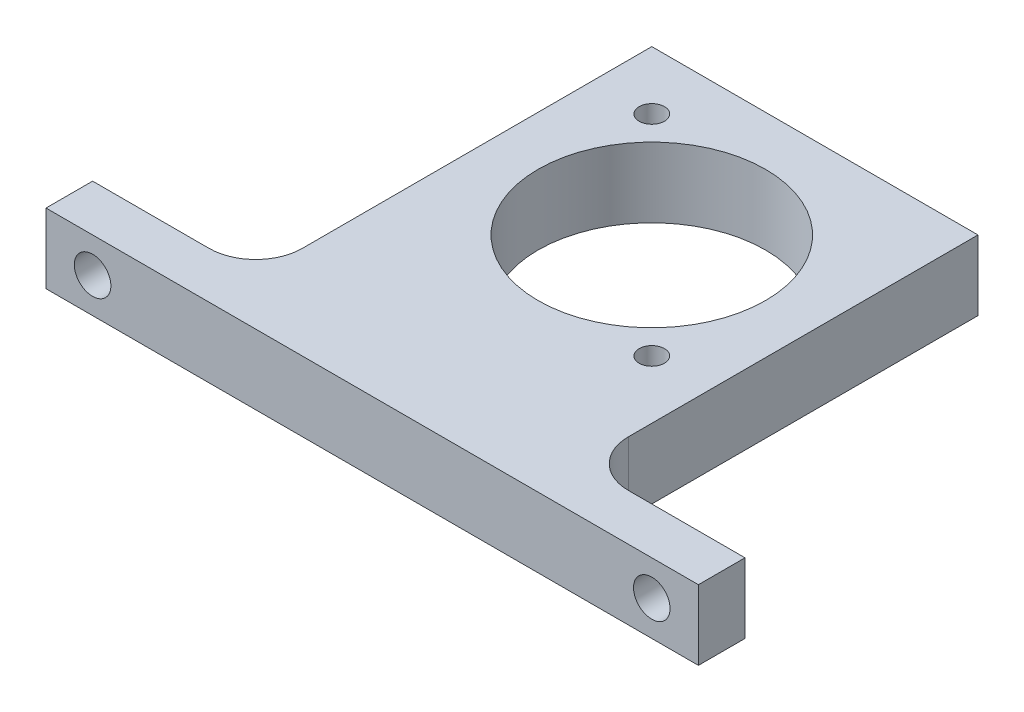
ISO-10303-21;
HEADER;
FILE_DESCRIPTION(('STEP AP214'),'2;1');
FILE_NAME('part.step','',(''),(''),'','','');
FILE_SCHEMA(('AUTOMOTIVE_DESIGN { 1 0 10303 214 1 1 1 1 }'));
ENDSEC;
DATA;
#1=APPLICATION_CONTEXT('core data for automotive mechanical design processes');
#2=APPLICATION_PROTOCOL_DEFINITION('international standard','automotive_design',2000,#1);
#3=PRODUCT_CONTEXT('',#1,'mechanical');
#4=PRODUCT('Part','Part','',(#3));
#5=PRODUCT_RELATED_PRODUCT_CATEGORY('part','',(#4));
#6=PRODUCT_DEFINITION_FORMATION('','',#4);
#7=PRODUCT_DEFINITION_CONTEXT('part definition',#1,'design');
#8=PRODUCT_DEFINITION('design','',#6,#7);
#9=PRODUCT_DEFINITION_SHAPE('','',#8);
#10=(LENGTH_UNIT() NAMED_UNIT(*) SI_UNIT(.MILLI.,.METRE.));
#11=(NAMED_UNIT(*) PLANE_ANGLE_UNIT() SI_UNIT($,.RADIAN.));
#12=(NAMED_UNIT(*) SI_UNIT($,.STERADIAN.) SOLID_ANGLE_UNIT());
#13=UNCERTAINTY_MEASURE_WITH_UNIT(LENGTH_MEASURE(1.E-05),#10,'distance_accuracy_value','');
#14=(GEOMETRIC_REPRESENTATION_CONTEXT(3) GLOBAL_UNCERTAINTY_ASSIGNED_CONTEXT((#13)) GLOBAL_UNIT_ASSIGNED_CONTEXT((#10,
#11,#12)) REPRESENTATION_CONTEXT('',''));
#15=CARTESIAN_POINT('',(0.,0.,0.));
#16=DIRECTION('',(0.,0.,1.));
#17=DIRECTION('',(1.,0.,0.));
#18=AXIS2_PLACEMENT_3D('',#15,#16,#17);
#19=CARTESIAN_POINT('',(-22.225,9.525,-22.225));
#20=DIRECTION('',(1.,0.,0.));
#21=DIRECTION('',(0.,0.,-1.));
#22=AXIS2_PLACEMENT_3D('',#19,#20,#21);
#23=PLANE('',#22);
#24=DIRECTION('',(0.,0.,1.));
#25=VECTOR('',#24,1.);
#26=CARTESIAN_POINT('',(-22.225,0.,-22.225));
#27=LINE('',#26,#25);
#28=CARTESIAN_POINT('',(-22.225,0.,-22.225));
#29=VERTEX_POINT('',#28);
#30=CARTESIAN_POINT('',(-22.225,0.,25.4));
#31=VERTEX_POINT('',#30);
#32=EDGE_CURVE('E158',#29,#31,#27,.T.);
#33=ORIENTED_EDGE('',*,*,#32,.T.);
#34=DIRECTION('',(0.,-1.,0.));
#35=VECTOR('',#34,1.);
#36=CARTESIAN_POINT('',(-22.225,9.525,25.4));
#37=LINE('',#36,#35);
#38=CARTESIAN_POINT('',(-22.225,9.525,25.4));
#39=VERTEX_POINT('',#38);
#40=EDGE_CURVE('E59',#31,#39,#37,.F.);
#41=ORIENTED_EDGE('',*,*,#40,.T.);
#42=DIRECTION('',(0.,0.,1.));
#43=VECTOR('',#42,1.);
#44=CARTESIAN_POINT('',(-22.225,9.525,-22.225));
#45=LINE('',#44,#43);
#46=CARTESIAN_POINT('',(-22.225,9.525,-22.225));
#47=VERTEX_POINT('',#46);
#48=EDGE_CURVE('E163',#47,#39,#45,.T.);
#49=ORIENTED_EDGE('',*,*,#48,.F.);
#50=DIRECTION('',(0.,-1.,0.));
#51=VECTOR('',#50,1.);
#52=CARTESIAN_POINT('',(-22.225,9.525,-22.225));
#53=LINE('',#52,#51);
#54=EDGE_CURVE('E172',#47,#29,#53,.T.);
#55=ORIENTED_EDGE('',*,*,#54,.T.);
#56=EDGE_LOOP('',(#33,#41,#49,#55));
#57=FACE_BOUND('',#56,.T.);
#58=ADVANCED_FACE('F38',(#57),#23,.F.);
#59=CARTESIAN_POINT('',(22.225,9.525,-22.225));
#60=DIRECTION('',(-1.,0.,0.));
#61=DIRECTION('',(0.,0.,1.));
#62=AXIS2_PLACEMENT_3D('',#59,#60,#61);
#63=PLANE('',#62);
#64=DIRECTION('',(0.,0.,-1.));
#65=VECTOR('',#64,1.);
#66=CARTESIAN_POINT('',(22.225,9.525,-22.225));
#67=LINE('',#66,#65);
#68=CARTESIAN_POINT('',(22.225,9.525,25.4));
#69=VERTEX_POINT('',#68);
#70=CARTESIAN_POINT('',(22.225,9.525,-22.225));
#71=VERTEX_POINT('',#70);
#72=EDGE_CURVE('E168',#69,#71,#67,.T.);
#73=ORIENTED_EDGE('',*,*,#72,.F.);
#74=DIRECTION('',(0.,1.,0.));
#75=VECTOR('',#74,1.);
#76=CARTESIAN_POINT('',(22.225,0.,25.4));
#77=LINE('',#76,#75);
#78=CARTESIAN_POINT('',(22.225,0.,25.4));
#79=VERTEX_POINT('',#78);
#80=EDGE_CURVE('E186',#69,#79,#77,.F.);
#81=ORIENTED_EDGE('',*,*,#80,.T.);
#82=DIRECTION('',(0.,0.,-1.));
#83=VECTOR('',#82,1.);
#84=CARTESIAN_POINT('',(22.225,0.,-22.225));
#85=LINE('',#84,#83);
#86=CARTESIAN_POINT('',(22.225,0.,-22.225));
#87=VERTEX_POINT('',#86);
#88=EDGE_CURVE('E175',#79,#87,#85,.T.);
#89=ORIENTED_EDGE('',*,*,#88,.T.);
#90=DIRECTION('',(0.,-1.,0.));
#91=VECTOR('',#90,1.);
#92=CARTESIAN_POINT('',(22.225,9.525,-22.225));
#93=LINE('',#92,#91);
#94=EDGE_CURVE('E180',#71,#87,#93,.T.);
#95=ORIENTED_EDGE('',*,*,#94,.F.);
#96=EDGE_LOOP('',(#73,#81,#89,#95));
#97=FACE_BOUND('',#96,.T.);
#98=ADVANCED_FACE('F211',(#97),#63,.F.);
#99=CARTESIAN_POINT('',(-22.225,9.525,38.1));
#100=DIRECTION('',(0.,0.,-1.));
#101=DIRECTION('',(-1.,0.,0.));
#102=AXIS2_PLACEMENT_3D('',#99,#100,#101);
#103=PLANE('',#102);
#104=CARTESIAN_POINT('',(-38.1,4.7625,38.1));
#105=DIRECTION('',(0.,0.,1.));
#106=DIRECTION('',(1.,0.,0.));
#107=AXIS2_PLACEMENT_3D('',#104,#105,#106);
#108=CIRCLE('',#107,2.4892);
#109=CARTESIAN_POINT('',(-35.6108,4.7625,38.1));
#110=VERTEX_POINT('',#109);
#111=EDGE_CURVE('E295',#110,#110,#108,.T.);
#112=ORIENTED_EDGE('',*,*,#111,.F.);
#113=EDGE_LOOP('',(#112));
#114=FACE_BOUND('',#113,.T.);
#115=CARTESIAN_POINT('',(38.1,4.7625,38.1));
#116=DIRECTION('',(0.,0.,1.));
#117=DIRECTION('',(-1.,0.,0.));
#118=AXIS2_PLACEMENT_3D('',#115,#116,#117);
#119=CIRCLE('',#118,2.4892);
#120=CARTESIAN_POINT('',(35.6108,4.7625,38.1));
#121=VERTEX_POINT('',#120);
#122=EDGE_CURVE('E294',#121,#121,#119,.T.);
#123=ORIENTED_EDGE('',*,*,#122,.F.);
#124=EDGE_LOOP('',(#123));
#125=FACE_BOUND('',#124,.T.);
#126=DIRECTION('',(1.,0.,0.));
#127=VECTOR('',#126,1.);
#128=CARTESIAN_POINT('',(-22.225,0.,38.1));
#129=LINE('',#128,#127);
#130=CARTESIAN_POINT('',(-44.45,0.,38.1));
#131=VERTEX_POINT('',#130);
#132=CARTESIAN_POINT('',(44.45,0.,38.1));
#133=VERTEX_POINT('',#132);
#134=EDGE_CURVE('E118',#131,#133,#129,.T.);
#135=ORIENTED_EDGE('',*,*,#134,.T.);
#136=DIRECTION('',(0.,1.,0.));
#137=VECTOR('',#136,1.);
#138=CARTESIAN_POINT('',(44.45,0.,38.1));
#139=LINE('',#138,#137);
#140=CARTESIAN_POINT('',(44.45,9.525,38.1));
#141=VERTEX_POINT('',#140);
#142=EDGE_CURVE('E141',#133,#141,#139,.T.);
#143=ORIENTED_EDGE('',*,*,#142,.T.);
#144=DIRECTION('',(1.,0.,0.));
#145=VECTOR('',#144,1.);
#146=CARTESIAN_POINT('',(-22.225,9.525,38.1));
#147=LINE('',#146,#145);
#148=CARTESIAN_POINT('',(-44.45,9.525,38.1));
#149=VERTEX_POINT('',#148);
#150=EDGE_CURVE('E165',#149,#141,#147,.T.);
#151=ORIENTED_EDGE('',*,*,#150,.F.);
#152=DIRECTION('',(0.,-1.,0.));
#153=VECTOR('',#152,1.);
#154=CARTESIAN_POINT('',(-44.45,0.,38.1));
#155=LINE('',#154,#153);
#156=EDGE_CURVE('E144',#149,#131,#155,.T.);
#157=ORIENTED_EDGE('',*,*,#156,.T.);
#158=EDGE_LOOP('',(#135,#143,#151,#157));
#159=FACE_BOUND('',#158,.T.);
#160=ADVANCED_FACE('F232',(#114,#125,#159),#103,.F.);
#161=CARTESIAN_POINT('',(-22.225,9.525,-22.225));
#162=DIRECTION('',(0.,0.,1.));
#163=DIRECTION('',(1.,0.,0.));
#164=AXIS2_PLACEMENT_3D('',#161,#162,#163);
#165=PLANE('',#164);
#166=DIRECTION('',(-1.,0.,0.));
#167=VECTOR('',#166,1.);
#168=CARTESIAN_POINT('',(-22.225,0.,-22.225));
#169=LINE('',#168,#167);
#170=EDGE_CURVE('E166',#87,#29,#169,.T.);
#171=ORIENTED_EDGE('',*,*,#170,.T.);
#172=ORIENTED_EDGE('',*,*,#54,.F.);
#173=DIRECTION('',(-1.,0.,0.));
#174=VECTOR('',#173,1.);
#175=CARTESIAN_POINT('',(-22.225,9.525,-22.225));
#176=LINE('',#175,#174);
#177=EDGE_CURVE('E170',#71,#47,#176,.T.);
#178=ORIENTED_EDGE('',*,*,#177,.F.);
#179=ORIENTED_EDGE('',*,*,#94,.T.);
#180=EDGE_LOOP('',(#171,#172,#178,#179));
#181=FACE_BOUND('',#180,.T.);
#182=ADVANCED_FACE('F215',(#181),#165,.F.);
#183=CARTESIAN_POINT('',(0.,9.525,0.));
#184=DIRECTION('',(0.,1.,0.));
#185=DIRECTION('',(0.,0.,1.));
#186=AXIS2_PLACEMENT_3D('',#183,#184,#185);
#187=PLANE('',#186);
#188=CARTESIAN_POINT('',(14.2786072325,9.525,14.2786072324999));
#189=DIRECTION('',(0.,1.,0.));
#190=DIRECTION('',(0.,0.,1.));
#191=AXIS2_PLACEMENT_3D('',#188,#189,#190);
#192=CIRCLE('',#191,1.7272);
#193=CARTESIAN_POINT('',(14.2786072325,9.525,16.0058072324999));
#194=VERTEX_POINT('',#193);
#195=EDGE_CURVE('E287',#194,#194,#192,.T.);
#196=ORIENTED_EDGE('',*,*,#195,.F.);
#197=EDGE_LOOP('',(#196));
#198=FACE_BOUND('',#197,.T.);
#199=CARTESIAN_POINT('',(-14.2786072325,9.525,-14.2786072324999));
#200=DIRECTION('',(0.,1.,0.));
#201=DIRECTION('',(0.,0.,1.));
#202=AXIS2_PLACEMENT_3D('',#199,#200,#201);
#203=CIRCLE('',#202,1.7272);
#204=CARTESIAN_POINT('',(-14.2786072325,9.525,-12.5514072324999));
#205=VERTEX_POINT('',#204);
#206=EDGE_CURVE('E274',#205,#205,#203,.T.);
#207=ORIENTED_EDGE('',*,*,#206,.F.);
#208=EDGE_LOOP('',(#207));
#209=FACE_BOUND('',#208,.T.);
#210=CARTESIAN_POINT('',(0.,9.525,0.));
#211=DIRECTION('',(0.,1.,0.));
#212=DIRECTION('',(0.,0.,1.));
#213=AXIS2_PLACEMENT_3D('',#210,#211,#212);
#214=CIRCLE('',#213,15.494);
#215=CARTESIAN_POINT('',(0.,9.525,15.494));
#216=VERTEX_POINT('',#215);
#217=EDGE_CURVE('E279',#216,#216,#214,.T.);
#218=ORIENTED_EDGE('',*,*,#217,.F.);
#219=EDGE_LOOP('',(#218));
#220=FACE_BOUND('',#219,.T.);
#221=ORIENTED_EDGE('',*,*,#150,.T.);
#222=DIRECTION('',(0.,0.,1.));
#223=VECTOR('',#222,1.);
#224=CARTESIAN_POINT('',(44.45,9.525,31.75));
#225=LINE('',#224,#223);
#226=CARTESIAN_POINT('',(44.45,9.525,31.75));
#227=VERTEX_POINT('',#226);
#228=EDGE_CURVE('E159',#227,#141,#225,.T.);
#229=ORIENTED_EDGE('',*,*,#228,.F.);
#230=DIRECTION('',(-1.,0.,0.));
#231=VECTOR('',#230,1.);
#232=CARTESIAN_POINT('',(0.,9.525,31.75));
#233=LINE('',#232,#231);
#234=CARTESIAN_POINT('',(28.575,9.525,31.75));
#235=VERTEX_POINT('',#234);
#236=EDGE_CURVE('E124',#227,#235,#233,.T.);
#237=ORIENTED_EDGE('',*,*,#236,.T.);
#238=CARTESIAN_POINT('',(28.575,9.525,25.4));
#239=DIRECTION('',(0.,1.,0.));
#240=DIRECTION('',(0.,0.,1.));
#241=AXIS2_PLACEMENT_3D('',#238,#239,#240);
#242=CIRCLE('',#241,6.35);
#243=EDGE_CURVE('E190',#235,#69,#242,.F.);
#244=ORIENTED_EDGE('',*,*,#243,.T.);
#245=ORIENTED_EDGE('',*,*,#72,.T.);
#246=ORIENTED_EDGE('',*,*,#177,.T.);
#247=ORIENTED_EDGE('',*,*,#48,.T.);
#248=CARTESIAN_POINT('',(-28.575,9.525,25.4));
#249=DIRECTION('',(0.,1.,0.));
#250=DIRECTION('',(0.,0.,1.));
#251=AXIS2_PLACEMENT_3D('',#248,#249,#250);
#252=CIRCLE('',#251,6.35);
#253=CARTESIAN_POINT('',(-28.575,9.525,31.75));
#254=VERTEX_POINT('',#253);
#255=EDGE_CURVE('E11',#39,#254,#252,.F.);
#256=ORIENTED_EDGE('',*,*,#255,.T.);
#257=CARTESIAN_POINT('',(-44.45,9.525,31.75));
#258=VERTEX_POINT('',#257);
#259=EDGE_CURVE('E152',#254,#258,#233,.T.);
#260=ORIENTED_EDGE('',*,*,#259,.T.);
#261=DIRECTION('',(0.,0.,1.));
#262=VECTOR('',#261,1.);
#263=CARTESIAN_POINT('',(-44.45,9.525,31.75));
#264=LINE('',#263,#262);
#265=EDGE_CURVE('E140',#258,#149,#264,.T.);
#266=ORIENTED_EDGE('',*,*,#265,.T.);
#267=EDGE_LOOP('',(#221,#229,#237,#244,#245,#246,#247,#256,#260,#266));
#268=FACE_BOUND('',#267,.T.);
#269=ADVANCED_FACE('F208',(#198,#209,#220,#268),#187,.T.);
#270=CARTESIAN_POINT('',(0.,0.,0.));
#271=DIRECTION('',(0.,1.,0.));
#272=DIRECTION('',(0.,0.,1.));
#273=AXIS2_PLACEMENT_3D('',#270,#271,#272);
#274=PLANE('',#273);
#275=CARTESIAN_POINT('',(14.2786072325,0.,14.2786072324999));
#276=DIRECTION('',(0.,1.,0.));
#277=DIRECTION('',(0.,0.,1.));
#278=AXIS2_PLACEMENT_3D('',#275,#276,#277);
#279=CIRCLE('',#278,1.7272);
#280=CARTESIAN_POINT('',(14.2786072325,0.,16.0058072324999));
#281=VERTEX_POINT('',#280);
#282=EDGE_CURVE('E284',#281,#281,#279,.F.);
#283=ORIENTED_EDGE('',*,*,#282,.F.);
#284=EDGE_LOOP('',(#283));
#285=FACE_BOUND('',#284,.T.);
#286=CARTESIAN_POINT('',(-14.2786072325,0.,-14.2786072324999));
#287=DIRECTION('',(0.,1.,0.));
#288=DIRECTION('',(0.,0.,1.));
#289=AXIS2_PLACEMENT_3D('',#286,#287,#288);
#290=CIRCLE('',#289,1.7272);
#291=CARTESIAN_POINT('',(-14.2786072325,0.,-12.5514072324999));
#292=VERTEX_POINT('',#291);
#293=EDGE_CURVE('E277',#292,#292,#290,.F.);
#294=ORIENTED_EDGE('',*,*,#293,.F.);
#295=EDGE_LOOP('',(#294));
#296=FACE_BOUND('',#295,.T.);
#297=CARTESIAN_POINT('',(0.,0.,0.));
#298=DIRECTION('',(0.,1.,0.));
#299=DIRECTION('',(0.,0.,1.));
#300=AXIS2_PLACEMENT_3D('',#297,#298,#299);
#301=CIRCLE('',#300,15.494);
#302=CARTESIAN_POINT('',(0.,0.,15.494));
#303=VERTEX_POINT('',#302);
#304=EDGE_CURVE('E282',#303,#303,#301,.F.);
#305=ORIENTED_EDGE('',*,*,#304,.F.);
#306=EDGE_LOOP('',(#305));
#307=FACE_BOUND('',#306,.T.);
#308=ORIENTED_EDGE('',*,*,#134,.F.);
#309=DIRECTION('',(0.,0.,1.));
#310=VECTOR('',#309,1.);
#311=CARTESIAN_POINT('',(-44.45,0.,31.75));
#312=LINE('',#311,#310);
#313=CARTESIAN_POINT('',(-44.45,0.,31.75));
#314=VERTEX_POINT('',#313);
#315=EDGE_CURVE('E113',#314,#131,#312,.T.);
#316=ORIENTED_EDGE('',*,*,#315,.F.);
#317=DIRECTION('',(1.,0.,0.));
#318=VECTOR('',#317,1.);
#319=CARTESIAN_POINT('',(0.,0.,31.75));
#320=LINE('',#319,#318);
#321=CARTESIAN_POINT('',(-28.575,0.,31.75));
#322=VERTEX_POINT('',#321);
#323=EDGE_CURVE('E116',#314,#322,#320,.T.);
#324=ORIENTED_EDGE('',*,*,#323,.T.);
#325=CARTESIAN_POINT('',(-28.575,0.,25.4));
#326=DIRECTION('',(0.,1.,0.));
#327=DIRECTION('',(0.,0.,1.));
#328=AXIS2_PLACEMENT_3D('',#325,#326,#327);
#329=CIRCLE('',#328,6.35);
#330=EDGE_CURVE('E46',#322,#31,#329,.T.);
#331=ORIENTED_EDGE('',*,*,#330,.T.);
#332=ORIENTED_EDGE('',*,*,#32,.F.);
#333=ORIENTED_EDGE('',*,*,#170,.F.);
#334=ORIENTED_EDGE('',*,*,#88,.F.);
#335=CARTESIAN_POINT('',(28.575,0.,25.4));
#336=DIRECTION('',(0.,1.,0.));
#337=DIRECTION('',(0.,0.,1.));
#338=AXIS2_PLACEMENT_3D('',#335,#336,#337);
#339=CIRCLE('',#338,6.35);
#340=CARTESIAN_POINT('',(28.575,0.,31.75));
#341=VERTEX_POINT('',#340);
#342=EDGE_CURVE('E192',#79,#341,#339,.T.);
#343=ORIENTED_EDGE('',*,*,#342,.T.);
#344=CARTESIAN_POINT('',(44.45,0.,31.75));
#345=VERTEX_POINT('',#344);
#346=EDGE_CURVE('E135',#341,#345,#320,.T.);
#347=ORIENTED_EDGE('',*,*,#346,.T.);
#348=DIRECTION('',(0.,0.,1.));
#349=VECTOR('',#348,1.);
#350=CARTESIAN_POINT('',(44.45,0.,31.75));
#351=LINE('',#350,#349);
#352=EDGE_CURVE('E123',#345,#133,#351,.T.);
#353=ORIENTED_EDGE('',*,*,#352,.T.);
#354=EDGE_LOOP('',(#308,#316,#324,#331,#332,#333,#334,#343,#347,#353));
#355=FACE_BOUND('',#354,.T.);
#356=ADVANCED_FACE('F115',(#285,#296,#307,#355),#274,.F.);
#357=CARTESIAN_POINT('',(44.45,0.,31.75));
#358=DIRECTION('',(1.,0.,0.));
#359=DIRECTION('',(0.,0.,-1.));
#360=AXIS2_PLACEMENT_3D('',#357,#358,#359);
#361=PLANE('',#360);
#362=ORIENTED_EDGE('',*,*,#142,.F.);
#363=ORIENTED_EDGE('',*,*,#352,.F.);
#364=DIRECTION('',(0.,1.,0.));
#365=VECTOR('',#364,1.);
#366=CARTESIAN_POINT('',(44.45,0.,31.75));
#367=LINE('',#366,#365);
#368=EDGE_CURVE('E134',#345,#227,#367,.T.);
#369=ORIENTED_EDGE('',*,*,#368,.T.);
#370=ORIENTED_EDGE('',*,*,#228,.T.);
#371=EDGE_LOOP('',(#362,#363,#369,#370));
#372=FACE_BOUND('',#371,.T.);
#373=ADVANCED_FACE('F242',(#372),#361,.T.);
#374=CARTESIAN_POINT('',(0.,0.,31.75));
#375=DIRECTION('',(0.,0.,1.));
#376=DIRECTION('',(1.,0.,0.));
#377=AXIS2_PLACEMENT_3D('',#374,#375,#376);
#378=PLANE('',#377);
#379=CARTESIAN_POINT('',(38.1,4.7625,31.75));
#380=DIRECTION('',(0.,0.,1.));
#381=DIRECTION('',(1.,0.,0.));
#382=AXIS2_PLACEMENT_3D('',#379,#380,#381);
#383=CIRCLE('',#382,2.4892);
#384=CARTESIAN_POINT('',(40.5892,4.7625,31.75));
#385=VERTEX_POINT('',#384);
#386=EDGE_CURVE('E147',#385,#385,#383,.F.);
#387=ORIENTED_EDGE('',*,*,#386,.F.);
#388=EDGE_LOOP('',(#387));
#389=FACE_BOUND('',#388,.T.);
#390=ORIENTED_EDGE('',*,*,#346,.F.);
#391=DIRECTION('',(0.,1.,0.));
#392=VECTOR('',#391,1.);
#393=CARTESIAN_POINT('',(28.575,9.525,31.75));
#394=LINE('',#393,#392);
#395=EDGE_CURVE('E183',#341,#235,#394,.T.);
#396=ORIENTED_EDGE('',*,*,#395,.T.);
#397=ORIENTED_EDGE('',*,*,#236,.F.);
#398=ORIENTED_EDGE('',*,*,#368,.F.);
#399=EDGE_LOOP('',(#390,#396,#397,#398));
#400=FACE_BOUND('',#399,.T.);
#401=ADVANCED_FACE('F203',(#389,#400),#378,.F.);
#402=CARTESIAN_POINT('',(-38.1,4.7625,31.75));
#403=DIRECTION('',(0.,0.,1.));
#404=DIRECTION('',(1.,0.,0.));
#405=AXIS2_PLACEMENT_3D('',#402,#403,#404);
#406=CIRCLE('',#405,2.4892);
#407=CARTESIAN_POINT('',(-35.6108,4.7625,31.75));
#408=VERTEX_POINT('',#407);
#409=EDGE_CURVE('E155',#408,#408,#406,.F.);
#410=ORIENTED_EDGE('',*,*,#409,.F.);
#411=EDGE_LOOP('',(#410));
#412=FACE_BOUND('',#411,.T.);
#413=ORIENTED_EDGE('',*,*,#259,.F.);
#414=DIRECTION('',(0.,-1.,0.));
#415=VECTOR('',#414,1.);
#416=CARTESIAN_POINT('',(-28.575,0.,31.75));
#417=LINE('',#416,#415);
#418=EDGE_CURVE('E133',#254,#322,#417,.T.);
#419=ORIENTED_EDGE('',*,*,#418,.T.);
#420=ORIENTED_EDGE('',*,*,#323,.F.);
#421=DIRECTION('',(0.,-1.,0.));
#422=VECTOR('',#421,1.);
#423=CARTESIAN_POINT('',(-44.45,0.,31.75));
#424=LINE('',#423,#422);
#425=EDGE_CURVE('E131',#258,#314,#424,.T.);
#426=ORIENTED_EDGE('',*,*,#425,.F.);
#427=EDGE_LOOP('',(#413,#419,#420,#426));
#428=FACE_BOUND('',#427,.T.);
#429=ADVANCED_FACE('F130',(#412,#428),#378,.F.);
#430=CARTESIAN_POINT('',(-44.45,0.,31.75));
#431=DIRECTION('',(-1.,0.,0.));
#432=DIRECTION('',(0.,0.,1.));
#433=AXIS2_PLACEMENT_3D('',#430,#431,#432);
#434=PLANE('',#433);
#435=ORIENTED_EDGE('',*,*,#156,.F.);
#436=ORIENTED_EDGE('',*,*,#265,.F.);
#437=ORIENTED_EDGE('',*,*,#425,.T.);
#438=ORIENTED_EDGE('',*,*,#315,.T.);
#439=EDGE_LOOP('',(#435,#436,#437,#438));
#440=FACE_BOUND('',#439,.T.);
#441=ADVANCED_FACE('F138',(#440),#434,.T.);
#442=CARTESIAN_POINT('',(28.575,0.,25.4));
#443=DIRECTION('',(0.,-1.,0.));
#444=DIRECTION('',(0.,0.,-1.));
#445=AXIS2_PLACEMENT_3D('',#442,#443,#444);
#446=CYLINDRICAL_SURFACE('',#445,6.35);
#447=ORIENTED_EDGE('',*,*,#342,.F.);
#448=ORIENTED_EDGE('',*,*,#80,.F.);
#449=ORIENTED_EDGE('',*,*,#243,.F.);
#450=ORIENTED_EDGE('',*,*,#395,.F.);
#451=EDGE_LOOP('',(#447,#448,#449,#450));
#452=FACE_BOUND('',#451,.T.);
#453=ADVANCED_FACE('F205',(#452),#446,.F.);
#454=CARTESIAN_POINT('',(-28.575,0.,25.4));
#455=DIRECTION('',(0.,1.,0.));
#456=DIRECTION('',(0.,0.,1.));
#457=AXIS2_PLACEMENT_3D('',#454,#455,#456);
#458=CYLINDRICAL_SURFACE('',#457,6.35);
#459=ORIENTED_EDGE('',*,*,#255,.F.);
#460=ORIENTED_EDGE('',*,*,#40,.F.);
#461=ORIENTED_EDGE('',*,*,#330,.F.);
#462=ORIENTED_EDGE('',*,*,#418,.F.);
#463=EDGE_LOOP('',(#459,#460,#461,#462));
#464=FACE_BOUND('',#463,.T.);
#465=ADVANCED_FACE('F40',(#464),#458,.F.);
#466=CARTESIAN_POINT('',(-38.1,4.7625,24.7094792010818));
#467=DIRECTION('',(0.,0.,1.));
#468=DIRECTION('',(1.,0.,0.));
#469=AXIS2_PLACEMENT_3D('',#466,#467,#468);
#470=CYLINDRICAL_SURFACE('',#469,2.4892);
#471=ORIENTED_EDGE('',*,*,#409,.T.);
#472=EDGE_LOOP('',(#471));
#473=FACE_BOUND('',#472,.T.);
#474=ORIENTED_EDGE('',*,*,#111,.T.);
#475=EDGE_LOOP('',(#474));
#476=FACE_BOUND('',#475,.T.);
#477=ADVANCED_FACE('F219',(#473,#476),#470,.F.);
#478=CARTESIAN_POINT('',(38.1,4.7625,24.7094792010818));
#479=DIRECTION('',(0.,0.,1.));
#480=DIRECTION('',(1.,0.,0.));
#481=AXIS2_PLACEMENT_3D('',#478,#479,#480);
#482=CYLINDRICAL_SURFACE('',#481,2.4892);
#483=ORIENTED_EDGE('',*,*,#386,.T.);
#484=EDGE_LOOP('',(#483));
#485=FACE_BOUND('',#484,.T.);
#486=ORIENTED_EDGE('',*,*,#122,.T.);
#487=EDGE_LOOP('',(#486));
#488=FACE_BOUND('',#487,.T.);
#489=ADVANCED_FACE('F224',(#485,#488),#482,.F.);
#490=CARTESIAN_POINT('',(0.,-0.000999999999999265,0.));
#491=DIRECTION('',(0.,1.,0.));
#492=DIRECTION('',(0.,0.,1.));
#493=AXIS2_PLACEMENT_3D('',#490,#491,#492);
#494=CYLINDRICAL_SURFACE('',#493,15.494);
#495=ORIENTED_EDGE('',*,*,#217,.T.);
#496=EDGE_LOOP('',(#495));
#497=FACE_BOUND('',#496,.T.);
#498=ORIENTED_EDGE('',*,*,#304,.T.);
#499=EDGE_LOOP('',(#498));
#500=FACE_BOUND('',#499,.T.);
#501=ADVANCED_FACE('F256',(#497,#500),#494,.F.);
#502=CARTESIAN_POINT('',(-14.2786072325,-0.000999999999999265,-14.2786072324999));
#503=DIRECTION('',(0.,1.,0.));
#504=DIRECTION('',(0.,0.,1.));
#505=AXIS2_PLACEMENT_3D('',#502,#503,#504);
#506=CYLINDRICAL_SURFACE('',#505,1.7272);
#507=ORIENTED_EDGE('',*,*,#206,.T.);
#508=EDGE_LOOP('',(#507));
#509=FACE_BOUND('',#508,.T.);
#510=ORIENTED_EDGE('',*,*,#293,.T.);
#511=EDGE_LOOP('',(#510));
#512=FACE_BOUND('',#511,.T.);
#513=ADVANCED_FACE('F261',(#509,#512),#506,.F.);
#514=CARTESIAN_POINT('',(14.2786072325,-0.000999999999999265,14.2786072324999));
#515=DIRECTION('',(0.,1.,0.));
#516=DIRECTION('',(0.,0.,1.));
#517=AXIS2_PLACEMENT_3D('',#514,#515,#516);
#518=CYLINDRICAL_SURFACE('',#517,1.7272);
#519=ORIENTED_EDGE('',*,*,#195,.T.);
#520=EDGE_LOOP('',(#519));
#521=FACE_BOUND('',#520,.T.);
#522=ORIENTED_EDGE('',*,*,#282,.T.);
#523=EDGE_LOOP('',(#522));
#524=FACE_BOUND('',#523,.T.);
#525=ADVANCED_FACE('F263',(#521,#524),#518,.F.);
#526=CLOSED_SHELL('',(#58,#98,#160,#182,#269,#356,#373,#401,#429,#441,#453,#465,#477,#489,#501,
#513,#525));
#527=MANIFOLD_SOLID_BREP('B2',#526);
#528=ADVANCED_BREP_SHAPE_REPRESENTATION('',(#18,#527),#14);
#529=SHAPE_DEFINITION_REPRESENTATION(#9,#528);
ENDSEC;
END-ISO-10303-21;
